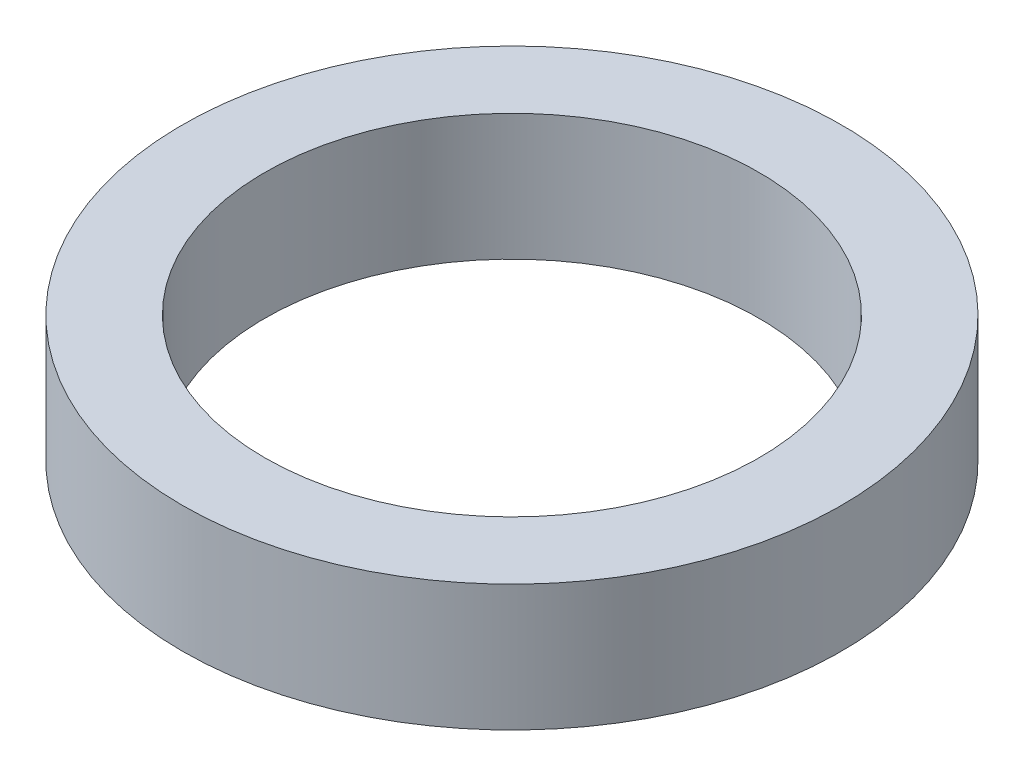
ISO-10303-21;
HEADER;
FILE_DESCRIPTION(('STEP AP214'),'2;1');
FILE_NAME('part.step','',(''),(''),'','','');
FILE_SCHEMA(('AUTOMOTIVE_DESIGN { 1 0 10303 214 1 1 1 1 }'));
ENDSEC;
DATA;
#1=APPLICATION_CONTEXT('core data for automotive mechanical design processes');
#2=APPLICATION_PROTOCOL_DEFINITION('international standard','automotive_design',2000,#1);
#3=PRODUCT_CONTEXT('',#1,'mechanical');
#4=PRODUCT('Part','Part','',(#3));
#5=PRODUCT_RELATED_PRODUCT_CATEGORY('part','',(#4));
#6=PRODUCT_DEFINITION_FORMATION('','',#4);
#7=PRODUCT_DEFINITION_CONTEXT('part definition',#1,'design');
#8=PRODUCT_DEFINITION('design','',#6,#7);
#9=PRODUCT_DEFINITION_SHAPE('','',#8);
#10=(LENGTH_UNIT() NAMED_UNIT(*) SI_UNIT(.MILLI.,.METRE.));
#11=(NAMED_UNIT(*) PLANE_ANGLE_UNIT() SI_UNIT($,.RADIAN.));
#12=(NAMED_UNIT(*) SI_UNIT($,.STERADIAN.) SOLID_ANGLE_UNIT());
#13=UNCERTAINTY_MEASURE_WITH_UNIT(LENGTH_MEASURE(1.E-05),#10,'distance_accuracy_value','');
#14=(GEOMETRIC_REPRESENTATION_CONTEXT(3) GLOBAL_UNCERTAINTY_ASSIGNED_CONTEXT((#13)) GLOBAL_UNIT_ASSIGNED_CONTEXT((#10,
#11,#12)) REPRESENTATION_CONTEXT('',''));
#15=CARTESIAN_POINT('',(0.,0.,0.));
#16=DIRECTION('',(0.,0.,1.));
#17=DIRECTION('',(1.,0.,0.));
#18=AXIS2_PLACEMENT_3D('',#15,#16,#17);
#19=CARTESIAN_POINT('',(0.,23.,0.));
#20=DIRECTION('',(0.,-1.,0.));
#21=DIRECTION('',(0.,0.,-1.));
#22=AXIS2_PLACEMENT_3D('',#19,#20,#21);
#23=CYLINDRICAL_SURFACE('',#22,60.);
#24=CARTESIAN_POINT('',(0.,23.,0.));
#25=DIRECTION('',(0.,1.,0.));
#26=DIRECTION('',(0.,0.,1.));
#27=AXIS2_PLACEMENT_3D('',#24,#25,#26);
#28=CIRCLE('',#27,60.);
#29=CARTESIAN_POINT('',(0.,23.,60.));
#30=VERTEX_POINT('',#29);
#31=EDGE_CURVE('E10',#30,#30,#28,.T.);
#32=ORIENTED_EDGE('',*,*,#31,.F.);
#33=EDGE_LOOP('',(#32));
#34=FACE_BOUND('',#33,.T.);
#35=CARTESIAN_POINT('',(0.,0.,0.));
#36=DIRECTION('',(0.,1.,0.));
#37=DIRECTION('',(0.,0.,1.));
#38=AXIS2_PLACEMENT_3D('',#35,#36,#37);
#39=CIRCLE('',#38,60.);
#40=CARTESIAN_POINT('',(0.,0.,60.));
#41=VERTEX_POINT('',#40);
#42=EDGE_CURVE('E37',#41,#41,#39,.T.);
#43=ORIENTED_EDGE('',*,*,#42,.T.);
#44=EDGE_LOOP('',(#43));
#45=FACE_BOUND('',#44,.T.);
#46=ADVANCED_FACE('F40',(#34,#45),#23,.T.);
#47=CARTESIAN_POINT('',(0.,23.,0.));
#48=DIRECTION('',(0.,1.,0.));
#49=DIRECTION('',(0.,0.,1.));
#50=AXIS2_PLACEMENT_3D('',#47,#48,#49);
#51=PLANE('',#50);
#52=CARTESIAN_POINT('',(0.,23.,0.));
#53=DIRECTION('',(0.,1.,0.));
#54=DIRECTION('',(0.,0.,1.));
#55=AXIS2_PLACEMENT_3D('',#52,#53,#54);
#56=CIRCLE('',#55,45.);
#57=CARTESIAN_POINT('',(0.,23.,45.));
#58=VERTEX_POINT('',#57);
#59=EDGE_CURVE('E50',#58,#58,#56,.T.);
#60=ORIENTED_EDGE('',*,*,#59,.F.);
#61=EDGE_LOOP('',(#60));
#62=FACE_BOUND('',#61,.T.);
#63=ORIENTED_EDGE('',*,*,#31,.T.);
#64=EDGE_LOOP('',(#63));
#65=FACE_BOUND('',#64,.T.);
#66=ADVANCED_FACE('F59',(#62,#65),#51,.T.);
#67=CARTESIAN_POINT('',(0.,0.,0.));
#68=DIRECTION('',(0.,1.,0.));
#69=DIRECTION('',(0.,0.,1.));
#70=AXIS2_PLACEMENT_3D('',#67,#68,#69);
#71=PLANE('',#70);
#72=CARTESIAN_POINT('',(0.,0.,0.));
#73=DIRECTION('',(0.,1.,0.));
#74=DIRECTION('',(0.,0.,1.));
#75=AXIS2_PLACEMENT_3D('',#72,#73,#74);
#76=CIRCLE('',#75,45.);
#77=CARTESIAN_POINT('',(0.,0.,45.));
#78=VERTEX_POINT('',#77);
#79=EDGE_CURVE('E47',#78,#78,#76,.T.);
#80=ORIENTED_EDGE('',*,*,#79,.T.);
#81=EDGE_LOOP('',(#80));
#82=FACE_BOUND('',#81,.T.);
#83=ORIENTED_EDGE('',*,*,#42,.F.);
#84=EDGE_LOOP('',(#83));
#85=FACE_BOUND('',#84,.T.);
#86=ADVANCED_FACE('F58',(#82,#85),#71,.F.);
#87=CARTESIAN_POINT('',(0.,23.,0.));
#88=DIRECTION('',(0.,-1.,0.));
#89=DIRECTION('',(0.,0.,-1.));
#90=AXIS2_PLACEMENT_3D('',#87,#88,#89);
#91=CYLINDRICAL_SURFACE('',#90,45.);
#92=ORIENTED_EDGE('',*,*,#59,.T.);
#93=EDGE_LOOP('',(#92));
#94=FACE_BOUND('',#93,.T.);
#95=ORIENTED_EDGE('',*,*,#79,.F.);
#96=EDGE_LOOP('',(#95));
#97=FACE_BOUND('',#96,.T.);
#98=ADVANCED_FACE('F54',(#94,#97),#91,.F.);
#99=CLOSED_SHELL('',(#46,#66,#86,#98));
#100=MANIFOLD_SOLID_BREP('B2',#99);
#101=ADVANCED_BREP_SHAPE_REPRESENTATION('',(#18,#100),#14);
#102=SHAPE_DEFINITION_REPRESENTATION(#9,#101);
ENDSEC;
END-ISO-10303-21;
